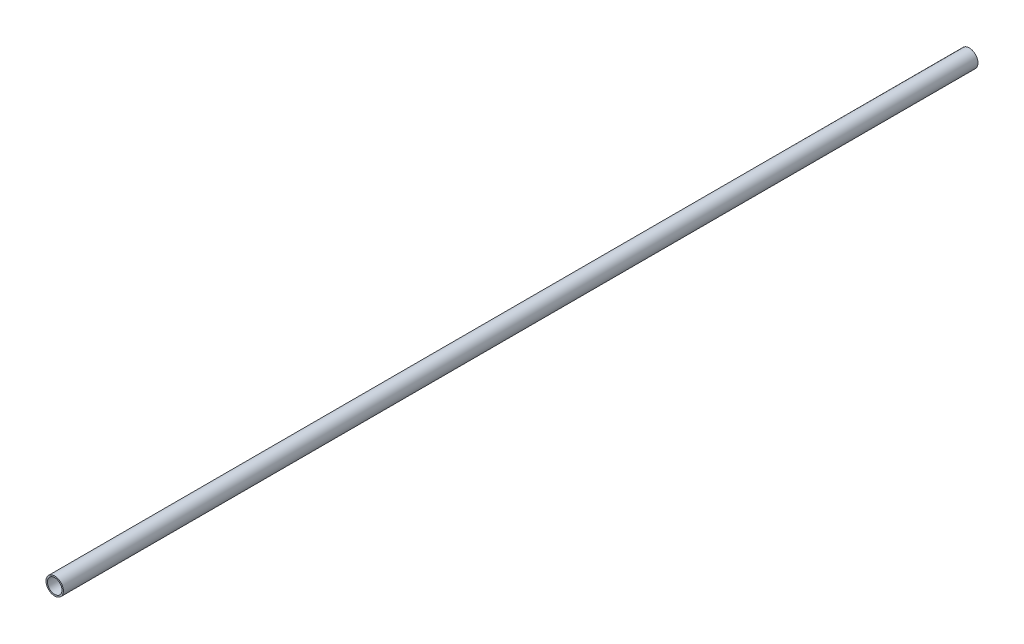
ISO-10303-21;
HEADER;
FILE_DESCRIPTION(('STEP AP214'),'2;1');
FILE_NAME('part.step','',(''),(''),'','','');
FILE_SCHEMA(('AUTOMOTIVE_DESIGN { 1 0 10303 214 1 1 1 1 }'));
ENDSEC;
DATA;
#1=APPLICATION_CONTEXT('core data for automotive mechanical design processes');
#2=APPLICATION_PROTOCOL_DEFINITION('international standard','automotive_design',2000,#1);
#3=PRODUCT_CONTEXT('',#1,'mechanical');
#4=PRODUCT('Part','Part','',(#3));
#5=PRODUCT_RELATED_PRODUCT_CATEGORY('part','',(#4));
#6=PRODUCT_DEFINITION_FORMATION('','',#4);
#7=PRODUCT_DEFINITION_CONTEXT('part definition',#1,'design');
#8=PRODUCT_DEFINITION('design','',#6,#7);
#9=PRODUCT_DEFINITION_SHAPE('','',#8);
#10=(LENGTH_UNIT() NAMED_UNIT(*) SI_UNIT(.MILLI.,.METRE.));
#11=(NAMED_UNIT(*) PLANE_ANGLE_UNIT() SI_UNIT($,.RADIAN.));
#12=(NAMED_UNIT(*) SI_UNIT($,.STERADIAN.) SOLID_ANGLE_UNIT());
#13=UNCERTAINTY_MEASURE_WITH_UNIT(LENGTH_MEASURE(1.E-05),#10,'distance_accuracy_value','');
#14=(GEOMETRIC_REPRESENTATION_CONTEXT(3) GLOBAL_UNCERTAINTY_ASSIGNED_CONTEXT((#13)) GLOBAL_UNIT_ASSIGNED_CONTEXT((#10,
#11,#12)) REPRESENTATION_CONTEXT('',''));
#15=CARTESIAN_POINT('',(0.,0.,0.));
#16=DIRECTION('',(0.,0.,1.));
#17=DIRECTION('',(1.,0.,0.));
#18=AXIS2_PLACEMENT_3D('',#15,#16,#17);
#19=CARTESIAN_POINT('',(0.,0.,1000.125));
#20=DIRECTION('',(0.,0.,1.));
#21=DIRECTION('',(1.,0.,0.));
#22=AXIS2_PLACEMENT_3D('',#19,#20,#21);
#23=PLANE('',#22);
#24=CARTESIAN_POINT('',(0.,0.,1000.125));
#25=DIRECTION('',(0.,0.,1.));
#26=DIRECTION('',(1.,0.,0.));
#27=AXIS2_PLACEMENT_3D('',#24,#25,#26);
#28=CIRCLE('',#27,9.525);
#29=CARTESIAN_POINT('',(9.525,0.,1000.125));
#30=VERTEX_POINT('',#29);
#31=EDGE_CURVE('E10',#30,#30,#28,.T.);
#32=ORIENTED_EDGE('',*,*,#31,.T.);
#33=EDGE_LOOP('',(#32));
#34=FACE_BOUND('',#33,.T.);
#35=CARTESIAN_POINT('',(0.,0.,1000.125));
#36=DIRECTION('',(0.,0.,1.));
#37=DIRECTION('',(1.,0.,0.));
#38=AXIS2_PLACEMENT_3D('',#35,#36,#37);
#39=CIRCLE('',#38,7.9375);
#40=CARTESIAN_POINT('',(7.9375,0.,1000.125));
#41=VERTEX_POINT('',#40);
#42=EDGE_CURVE('E50',#41,#41,#39,.T.);
#43=ORIENTED_EDGE('',*,*,#42,.F.);
#44=EDGE_LOOP('',(#43));
#45=FACE_BOUND('',#44,.T.);
#46=ADVANCED_FACE('F39',(#34,#45),#23,.T.);
#47=CARTESIAN_POINT('',(0.,0.,0.));
#48=DIRECTION('',(0.,0.,1.));
#49=DIRECTION('',(1.,0.,0.));
#50=AXIS2_PLACEMENT_3D('',#47,#48,#49);
#51=PLANE('',#50);
#52=CARTESIAN_POINT('',(0.,0.,0.));
#53=DIRECTION('',(0.,0.,1.));
#54=DIRECTION('',(1.,0.,0.));
#55=AXIS2_PLACEMENT_3D('',#52,#53,#54);
#56=CIRCLE('',#55,9.525);
#57=CARTESIAN_POINT('',(9.525,0.,0.));
#58=VERTEX_POINT('',#57);
#59=EDGE_CURVE('E43',#58,#58,#56,.T.);
#60=ORIENTED_EDGE('',*,*,#59,.F.);
#61=EDGE_LOOP('',(#60));
#62=FACE_BOUND('',#61,.T.);
#63=CARTESIAN_POINT('',(0.,0.,0.));
#64=DIRECTION('',(0.,0.,1.));
#65=DIRECTION('',(1.,0.,0.));
#66=AXIS2_PLACEMENT_3D('',#63,#64,#65);
#67=CIRCLE('',#66,7.9375);
#68=CARTESIAN_POINT('',(7.9375,0.,0.));
#69=VERTEX_POINT('',#68);
#70=EDGE_CURVE('E52',#69,#69,#67,.T.);
#71=ORIENTED_EDGE('',*,*,#70,.T.);
#72=EDGE_LOOP('',(#71));
#73=FACE_BOUND('',#72,.T.);
#74=ADVANCED_FACE('F62',(#62,#73),#51,.F.);
#75=CARTESIAN_POINT('',(0.,0.,1000.125));
#76=DIRECTION('',(0.,0.,-1.));
#77=DIRECTION('',(-1.,0.,0.));
#78=AXIS2_PLACEMENT_3D('',#75,#76,#77);
#79=CYLINDRICAL_SURFACE('',#78,9.525);
#80=ORIENTED_EDGE('',*,*,#31,.F.);
#81=EDGE_LOOP('',(#80));
#82=FACE_BOUND('',#81,.T.);
#83=ORIENTED_EDGE('',*,*,#59,.T.);
#84=EDGE_LOOP('',(#83));
#85=FACE_BOUND('',#84,.T.);
#86=ADVANCED_FACE('F41',(#82,#85),#79,.T.);
#87=CARTESIAN_POINT('',(0.,0.,1000.125));
#88=DIRECTION('',(0.,0.,-1.));
#89=DIRECTION('',(-1.,0.,0.));
#90=AXIS2_PLACEMENT_3D('',#87,#88,#89);
#91=CYLINDRICAL_SURFACE('',#90,7.9375);
#92=ORIENTED_EDGE('',*,*,#42,.T.);
#93=EDGE_LOOP('',(#92));
#94=FACE_BOUND('',#93,.T.);
#95=ORIENTED_EDGE('',*,*,#70,.F.);
#96=EDGE_LOOP('',(#95));
#97=FACE_BOUND('',#96,.T.);
#98=ADVANCED_FACE('F58',(#94,#97),#91,.F.);
#99=CLOSED_SHELL('',(#46,#74,#86,#98));
#100=MANIFOLD_SOLID_BREP('B2',#99);
#101=ADVANCED_BREP_SHAPE_REPRESENTATION('',(#18,#100),#14);
#102=SHAPE_DEFINITION_REPRESENTATION(#9,#101);
ENDSEC;
END-ISO-10303-21;
